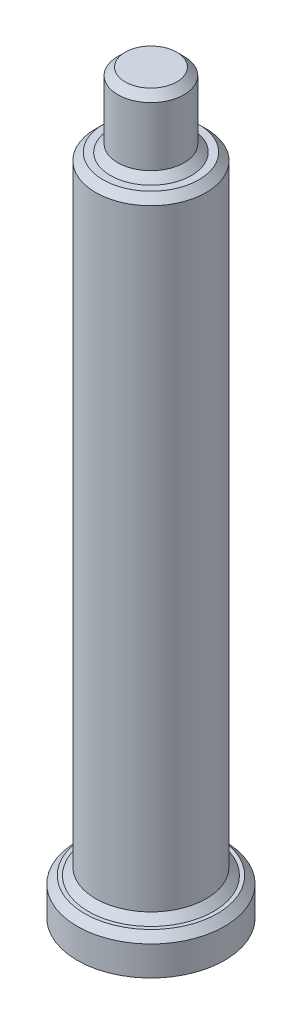
ISO-10303-21;
HEADER;
FILE_DESCRIPTION(('STEP AP214'),'2;1');
FILE_NAME('part.step','',(''),(''),'','','');
FILE_SCHEMA(('AUTOMOTIVE_DESIGN { 1 0 10303 214 1 1 1 1 }'));
ENDSEC;
DATA;
#1=APPLICATION_CONTEXT('core data for automotive mechanical design processes');
#2=APPLICATION_PROTOCOL_DEFINITION('international standard','automotive_design',2000,#1);
#3=PRODUCT_CONTEXT('',#1,'mechanical');
#4=PRODUCT('Part','Part','',(#3));
#5=PRODUCT_RELATED_PRODUCT_CATEGORY('part','',(#4));
#6=PRODUCT_DEFINITION_FORMATION('','',#4);
#7=PRODUCT_DEFINITION_CONTEXT('part definition',#1,'design');
#8=PRODUCT_DEFINITION('design','',#6,#7);
#9=PRODUCT_DEFINITION_SHAPE('','',#8);
#10=(LENGTH_UNIT() NAMED_UNIT(*) SI_UNIT(.MILLI.,.METRE.));
#11=(NAMED_UNIT(*) PLANE_ANGLE_UNIT() SI_UNIT($,.RADIAN.));
#12=(NAMED_UNIT(*) SI_UNIT($,.STERADIAN.) SOLID_ANGLE_UNIT());
#13=UNCERTAINTY_MEASURE_WITH_UNIT(LENGTH_MEASURE(1.E-05),#10,'distance_accuracy_value','');
#14=(GEOMETRIC_REPRESENTATION_CONTEXT(3) GLOBAL_UNCERTAINTY_ASSIGNED_CONTEXT((#13)) GLOBAL_UNIT_ASSIGNED_CONTEXT((#10,
#11,#12)) REPRESENTATION_CONTEXT('',''));
#15=CARTESIAN_POINT('',(0.,0.,0.));
#16=DIRECTION('',(0.,0.,1.));
#17=DIRECTION('',(1.,0.,0.));
#18=AXIS2_PLACEMENT_3D('',#15,#16,#17);
#19=CARTESIAN_POINT('',(0.,0.5,0.));
#20=DIRECTION('',(0.,-1.,0.));
#21=DIRECTION('',(0.,0.,-1.));
#22=AXIS2_PLACEMENT_3D('',#19,#20,#21);
#23=CYLINDRICAL_SURFACE('',#22,1.);
#24=CARTESIAN_POINT('',(0.,0.400000000000003,0.));
#25=DIRECTION('',(0.,1.,0.));
#26=DIRECTION('',(0.,0.,1.));
#27=AXIS2_PLACEMENT_3D('',#24,#25,#26);
#28=CIRCLE('',#27,1.);
#29=CARTESIAN_POINT('',(0.,0.400000000000003,1.));
#30=VERTEX_POINT('',#29);
#31=EDGE_CURVE('E63',#30,#30,#28,.F.);
#32=ORIENTED_EDGE('',*,*,#31,.T.);
#33=EDGE_LOOP('',(#32));
#34=FACE_BOUND('',#33,.T.);
#35=CARTESIAN_POINT('',(0.,0.,0.));
#36=DIRECTION('',(0.,1.,0.));
#37=DIRECTION('',(0.,0.,1.));
#38=AXIS2_PLACEMENT_3D('',#35,#36,#37);
#39=CIRCLE('',#38,1.);
#40=CARTESIAN_POINT('',(0.,0.,1.));
#41=VERTEX_POINT('',#40);
#42=EDGE_CURVE('E78',#41,#41,#39,.T.);
#43=ORIENTED_EDGE('',*,*,#42,.T.);
#44=EDGE_LOOP('',(#43));
#45=FACE_BOUND('',#44,.T.);
#46=ADVANCED_FACE('F39',(#34,#45),#23,.T.);
#47=CARTESIAN_POINT('',(0.,0.5,0.));
#48=DIRECTION('',(0.,1.,0.));
#49=DIRECTION('',(0.,0.,1.));
#50=AXIS2_PLACEMENT_3D('',#47,#48,#49);
#51=PLANE('',#50);
#52=CARTESIAN_POINT('',(0.,0.5,0.));
#53=DIRECTION('',(0.,1.,0.));
#54=DIRECTION('',(0.,0.,1.));
#55=AXIS2_PLACEMENT_3D('',#52,#53,#54);
#56=CIRCLE('',#55,0.900000000000003);
#57=CARTESIAN_POINT('',(0.,0.5,0.900000000000003));
#58=VERTEX_POINT('',#57);
#59=EDGE_CURVE('E66',#58,#58,#56,.T.);
#60=ORIENTED_EDGE('',*,*,#59,.T.);
#61=EDGE_LOOP('',(#60));
#62=FACE_BOUND('',#61,.T.);
#63=CARTESIAN_POINT('',(0.,0.5,0.));
#64=DIRECTION('',(0.,1.,0.));
#65=DIRECTION('',(0.,0.,1.));
#66=AXIS2_PLACEMENT_3D('',#63,#64,#65);
#67=CIRCLE('',#66,0.85);
#68=CARTESIAN_POINT('',(0.,0.5,0.85));
#69=VERTEX_POINT('',#68);
#70=EDGE_CURVE('E69',#69,#69,#67,.F.);
#71=ORIENTED_EDGE('',*,*,#70,.T.);
#72=EDGE_LOOP('',(#71));
#73=FACE_BOUND('',#72,.T.);
#74=ADVANCED_FACE('F86',(#62,#73),#51,.T.);
#75=CARTESIAN_POINT('',(0.,0.,0.));
#76=DIRECTION('',(0.,1.,0.));
#77=DIRECTION('',(0.,0.,1.));
#78=AXIS2_PLACEMENT_3D('',#75,#76,#77);
#79=PLANE('',#78);
#80=ORIENTED_EDGE('',*,*,#42,.F.);
#81=EDGE_LOOP('',(#80));
#82=FACE_BOUND('',#81,.T.);
#83=ADVANCED_FACE('F83',(#82),#79,.F.);
#84=CARTESIAN_POINT('',(0.,9.,0.));
#85=DIRECTION('',(0.,-1.,0.));
#86=DIRECTION('',(0.,0.,-1.));
#87=AXIS2_PLACEMENT_3D('',#84,#85,#86);
#88=CYLINDRICAL_SURFACE('',#87,0.75);
#89=CARTESIAN_POINT('',(0.,8.9,0.));
#90=DIRECTION('',(0.,1.,0.));
#91=DIRECTION('',(0.,0.,1.));
#92=AXIS2_PLACEMENT_3D('',#89,#90,#91);
#93=CIRCLE('',#92,0.75);
#94=CARTESIAN_POINT('',(0.,8.9,0.75));
#95=VERTEX_POINT('',#94);
#96=EDGE_CURVE('E47',#95,#95,#93,.F.);
#97=ORIENTED_EDGE('',*,*,#96,.T.);
#98=EDGE_LOOP('',(#97));
#99=FACE_BOUND('',#98,.T.);
#100=CARTESIAN_POINT('',(0.,0.600000000000002,0.));
#101=DIRECTION('',(0.,1.,0.));
#102=DIRECTION('',(0.,0.,1.));
#103=AXIS2_PLACEMENT_3D('',#100,#101,#102);
#104=CIRCLE('',#103,0.75);
#105=CARTESIAN_POINT('',(0.,0.600000000000002,0.75));
#106=VERTEX_POINT('',#105);
#107=EDGE_CURVE('E60',#106,#106,#104,.T.);
#108=ORIENTED_EDGE('',*,*,#107,.T.);
#109=EDGE_LOOP('',(#108));
#110=FACE_BOUND('',#109,.T.);
#111=ADVANCED_FACE('F85',(#99,#110),#88,.T.);
#112=CARTESIAN_POINT('',(0.,9.,0.));
#113=DIRECTION('',(0.,1.,0.));
#114=DIRECTION('',(0.,0.,1.));
#115=AXIS2_PLACEMENT_3D('',#112,#113,#114);
#116=PLANE('',#115);
#117=CARTESIAN_POINT('',(0.,9.,0.));
#118=DIRECTION('',(0.,1.,0.));
#119=DIRECTION('',(0.,0.,1.));
#120=AXIS2_PLACEMENT_3D('',#117,#118,#119);
#121=CIRCLE('',#120,0.650000000000001);
#122=CARTESIAN_POINT('',(0.,9.,0.650000000000001));
#123=VERTEX_POINT('',#122);
#124=EDGE_CURVE('E51',#123,#123,#121,.T.);
#125=ORIENTED_EDGE('',*,*,#124,.T.);
#126=EDGE_LOOP('',(#125));
#127=FACE_BOUND('',#126,.T.);
#128=CARTESIAN_POINT('',(0.,9.,0.));
#129=DIRECTION('',(0.,1.,0.));
#130=DIRECTION('',(0.,0.,1.));
#131=AXIS2_PLACEMENT_3D('',#128,#129,#130);
#132=CIRCLE('',#131,0.549999999999997);
#133=CARTESIAN_POINT('',(0.,9.,0.549999999999997));
#134=VERTEX_POINT('',#133);
#135=EDGE_CURVE('E55',#134,#134,#132,.F.);
#136=ORIENTED_EDGE('',*,*,#135,.T.);
#137=EDGE_LOOP('',(#136));
#138=FACE_BOUND('',#137,.T.);
#139=ADVANCED_FACE('F92',(#127,#138),#116,.T.);
#140=CARTESIAN_POINT('',(0.,10.,0.));
#141=DIRECTION('',(0.,1.,0.));
#142=DIRECTION('',(0.,0.,1.));
#143=AXIS2_PLACEMENT_3D('',#140,#141,#142);
#144=PLANE('',#143);
#145=CARTESIAN_POINT('',(0.,10.,0.));
#146=DIRECTION('',(0.,1.,0.));
#147=DIRECTION('',(0.,0.,1.));
#148=AXIS2_PLACEMENT_3D('',#145,#146,#147);
#149=CIRCLE('',#148,0.35);
#150=CARTESIAN_POINT('',(0.,10.,0.35));
#151=VERTEX_POINT('',#150);
#152=EDGE_CURVE('E75',#151,#151,#149,.T.);
#153=ORIENTED_EDGE('',*,*,#152,.T.);
#154=EDGE_LOOP('',(#153));
#155=FACE_BOUND('',#154,.T.);
#156=ADVANCED_FACE('F138',(#155),#144,.T.);
#157=CARTESIAN_POINT('',(0.,10.,0.));
#158=DIRECTION('',(0.,-1.,0.));
#159=DIRECTION('',(0.,0.,-1.));
#160=AXIS2_PLACEMENT_3D('',#157,#158,#159);
#161=CYLINDRICAL_SURFACE('',#160,0.45);
#162=CARTESIAN_POINT('',(0.,9.1,0.));
#163=DIRECTION('',(0.,1.,0.));
#164=DIRECTION('',(0.,0.,1.));
#165=AXIS2_PLACEMENT_3D('',#162,#163,#164);
#166=CIRCLE('',#165,0.45);
#167=CARTESIAN_POINT('',(0.,9.1,0.45));
#168=VERTEX_POINT('',#167);
#169=EDGE_CURVE('E10',#168,#168,#166,.T.);
#170=ORIENTED_EDGE('',*,*,#169,.T.);
#171=EDGE_LOOP('',(#170));
#172=FACE_BOUND('',#171,.T.);
#173=CARTESIAN_POINT('',(0.,9.9,0.));
#174=DIRECTION('',(0.,1.,0.));
#175=DIRECTION('',(0.,0.,1.));
#176=AXIS2_PLACEMENT_3D('',#173,#174,#175);
#177=CIRCLE('',#176,0.45);
#178=CARTESIAN_POINT('',(0.,9.9,0.45));
#179=VERTEX_POINT('',#178);
#180=EDGE_CURVE('E72',#179,#179,#177,.F.);
#181=ORIENTED_EDGE('',*,*,#180,.T.);
#182=EDGE_LOOP('',(#181));
#183=FACE_BOUND('',#182,.T.);
#184=ADVANCED_FACE('F110',(#172,#183),#161,.T.);
#185=CARTESIAN_POINT('',(0.,10.,0.));
#186=DIRECTION('',(0.,-1.,0.));
#187=DIRECTION('',(0.,0.,-1.));
#188=AXIS2_PLACEMENT_3D('',#185,#186,#187);
#189=CONICAL_SURFACE('',#188,0.35,0.785398163397449);
#190=ORIENTED_EDGE('',*,*,#180,.F.);
#191=EDGE_LOOP('',(#190));
#192=FACE_BOUND('',#191,.T.);
#193=ORIENTED_EDGE('',*,*,#152,.F.);
#194=EDGE_LOOP('',(#193));
#195=FACE_BOUND('',#194,.T.);
#196=ADVANCED_FACE('F103',(#192,#195),#189,.T.);
#197=CARTESIAN_POINT('',(0.,0.5,0.));
#198=DIRECTION('',(0.,-1.,0.));
#199=DIRECTION('',(0.,0.,-1.));
#200=AXIS2_PLACEMENT_3D('',#197,#198,#199);
#201=CONICAL_SURFACE('',#200,0.900000000000003,0.785398163397448);
#202=ORIENTED_EDGE('',*,*,#31,.F.);
#203=EDGE_LOOP('',(#202));
#204=FACE_BOUND('',#203,.T.);
#205=ORIENTED_EDGE('',*,*,#59,.F.);
#206=EDGE_LOOP('',(#205));
#207=FACE_BOUND('',#206,.T.);
#208=ADVANCED_FACE('F109',(#204,#207),#201,.T.);
#209=CARTESIAN_POINT('',(0.,0.600000000000002,0.));
#210=DIRECTION('',(0.,-1.,0.));
#211=DIRECTION('',(0.,0.,-1.));
#212=AXIS2_PLACEMENT_3D('',#209,#210,#211);
#213=CONICAL_SURFACE('',#212,0.75,0.785398163397439);
#214=ORIENTED_EDGE('',*,*,#70,.F.);
#215=EDGE_LOOP('',(#214));
#216=FACE_BOUND('',#215,.T.);
#217=ORIENTED_EDGE('',*,*,#107,.F.);
#218=EDGE_LOOP('',(#217));
#219=FACE_BOUND('',#218,.T.);
#220=ADVANCED_FACE('F117',(#216,#219),#213,.T.);
#221=CARTESIAN_POINT('',(0.,9.,0.));
#222=DIRECTION('',(0.,-1.,0.));
#223=DIRECTION('',(0.,0.,-1.));
#224=AXIS2_PLACEMENT_3D('',#221,#222,#223);
#225=CONICAL_SURFACE('',#224,0.650000000000001,0.785398163397446);
#226=ORIENTED_EDGE('',*,*,#96,.F.);
#227=EDGE_LOOP('',(#226));
#228=FACE_BOUND('',#227,.T.);
#229=ORIENTED_EDGE('',*,*,#124,.F.);
#230=EDGE_LOOP('',(#229));
#231=FACE_BOUND('',#230,.T.);
#232=ADVANCED_FACE('F123',(#228,#231),#225,.T.);
#233=CARTESIAN_POINT('',(0.,9.1,0.));
#234=DIRECTION('',(0.,-1.,0.));
#235=DIRECTION('',(0.,0.,-1.));
#236=AXIS2_PLACEMENT_3D('',#233,#234,#235);
#237=CONICAL_SURFACE('',#236,0.45,0.785398163397439);
#238=ORIENTED_EDGE('',*,*,#135,.F.);
#239=EDGE_LOOP('',(#238));
#240=FACE_BOUND('',#239,.T.);
#241=ORIENTED_EDGE('',*,*,#169,.F.);
#242=EDGE_LOOP('',(#241));
#243=FACE_BOUND('',#242,.T.);
#244=ADVANCED_FACE('F42',(#240,#243),#237,.T.);
#245=CLOSED_SHELL('',(#46,#74,#83,#111,#139,#156,#184,#196,#208,#220,#232,#244));
#246=MANIFOLD_SOLID_BREP('B2',#245);
#247=ADVANCED_BREP_SHAPE_REPRESENTATION('',(#18,#246),#14);
#248=SHAPE_DEFINITION_REPRESENTATION(#9,#247);
ENDSEC;
END-ISO-10303-21;
